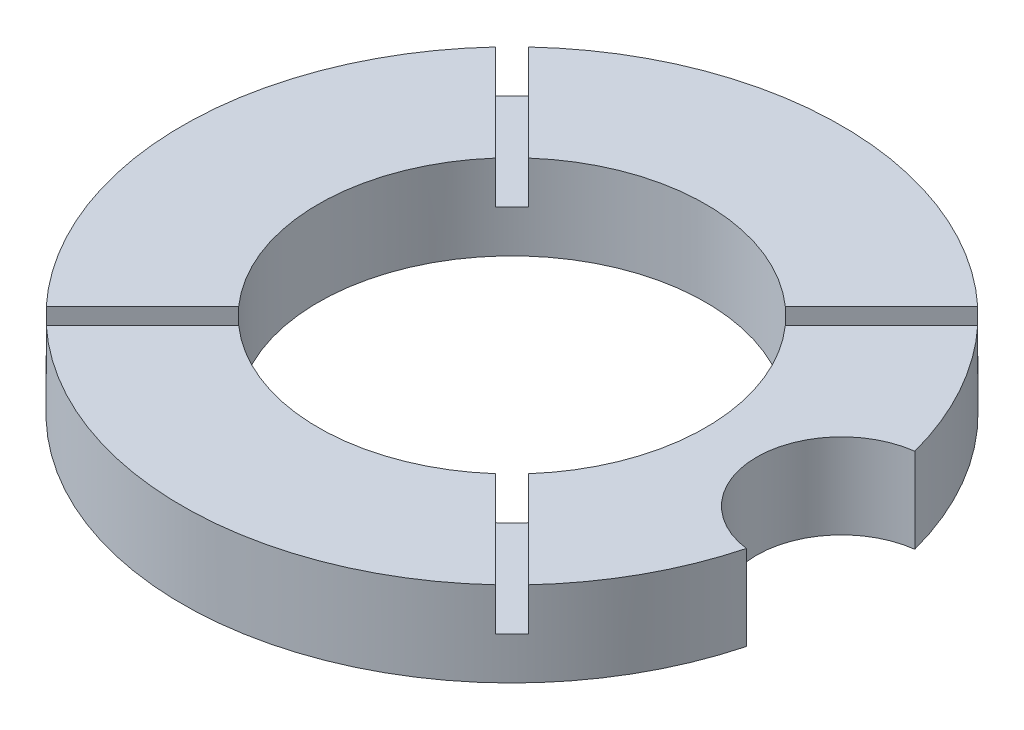
ISO-10303-21;
HEADER;
FILE_DESCRIPTION(('STEP AP214'),'2;1');
FILE_NAME('part.step','',(''),(''),'','','');
FILE_SCHEMA(('AUTOMOTIVE_DESIGN { 1 0 10303 214 1 1 1 1 }'));
ENDSEC;
DATA;
#1=APPLICATION_CONTEXT('core data for automotive mechanical design processes');
#2=APPLICATION_PROTOCOL_DEFINITION('international standard','automotive_design',2000,#1);
#3=PRODUCT_CONTEXT('',#1,'mechanical');
#4=PRODUCT('Part','Part','',(#3));
#5=PRODUCT_RELATED_PRODUCT_CATEGORY('part','',(#4));
#6=PRODUCT_DEFINITION_FORMATION('','',#4);
#7=PRODUCT_DEFINITION_CONTEXT('part definition',#1,'design');
#8=PRODUCT_DEFINITION('design','',#6,#7);
#9=PRODUCT_DEFINITION_SHAPE('','',#8);
#10=(LENGTH_UNIT() NAMED_UNIT(*) SI_UNIT(.MILLI.,.METRE.));
#11=(NAMED_UNIT(*) PLANE_ANGLE_UNIT() SI_UNIT($,.RADIAN.));
#12=(NAMED_UNIT(*) SI_UNIT($,.STERADIAN.) SOLID_ANGLE_UNIT());
#13=UNCERTAINTY_MEASURE_WITH_UNIT(LENGTH_MEASURE(1.E-05),#10,'distance_accuracy_value','');
#14=(GEOMETRIC_REPRESENTATION_CONTEXT(3) GLOBAL_UNCERTAINTY_ASSIGNED_CONTEXT((#13)) GLOBAL_UNIT_ASSIGNED_CONTEXT((#10,
#11,#12)) REPRESENTATION_CONTEXT('',''));
#15=CARTESIAN_POINT('',(0.,0.,0.));
#16=DIRECTION('',(0.,0.,1.));
#17=DIRECTION('',(1.,0.,0.));
#18=AXIS2_PLACEMENT_3D('',#15,#16,#17);
#19=CARTESIAN_POINT('',(0.,12.7,0.));
#20=DIRECTION('',(0.,-1.,0.));
#21=DIRECTION('',(0.,0.,-1.));
#22=AXIS2_PLACEMENT_3D('',#19,#20,#21);
#23=CYLINDRICAL_SURFACE('',#22,49.276);
#24=DIRECTION('',(0.,-1.,0.));
#25=VECTOR('',#24,1.);
#26=CARTESIAN_POINT('',(36.0606234607695,12.7,-33.5820727713553));
#27=LINE('',#26,#25);
#28=CARTESIAN_POINT('',(36.0606234607695,12.7,-33.5820727713553));
#29=VERTEX_POINT('',#28);
#30=CARTESIAN_POINT('',(36.0606234607695,6.35,-33.5820727713553));
#31=VERTEX_POINT('',#30);
#32=EDGE_CURVE('E367',#29,#31,#27,.T.);
#33=ORIENTED_EDGE('',*,*,#32,.F.);
#34=CARTESIAN_POINT('',(0.,12.7,0.));
#35=DIRECTION('',(0.,1.,0.));
#36=DIRECTION('',(0.,0.,1.));
#37=AXIS2_PLACEMENT_3D('',#34,#35,#36);
#38=CIRCLE('',#37,49.276);
#39=CARTESIAN_POINT('',(47.6394020618557,12.7,-12.5941076376559));
#40=VERTEX_POINT('',#39);
#41=EDGE_CURVE('E297',#40,#29,#38,.T.);
#42=ORIENTED_EDGE('',*,*,#41,.F.);
#43=DIRECTION('',(0.,1.,0.));
#44=VECTOR('',#43,1.);
#45=CARTESIAN_POINT('',(47.6394020618557,0.,-12.5941076376559));
#46=LINE('',#45,#44);
#47=CARTESIAN_POINT('',(47.6394020618557,0.,-12.5941076376559));
#48=VERTEX_POINT('',#47);
#49=EDGE_CURVE('E447',#48,#40,#46,.T.);
#50=ORIENTED_EDGE('',*,*,#49,.F.);
#51=CARTESIAN_POINT('',(0.,0.,0.));
#52=DIRECTION('',(0.,1.,0.));
#53=DIRECTION('',(0.,0.,1.));
#54=AXIS2_PLACEMENT_3D('',#51,#52,#53);
#55=CIRCLE('',#54,49.276);
#56=CARTESIAN_POINT('',(47.6394020618557,0.,12.5941076376559));
#57=VERTEX_POINT('',#56);
#58=EDGE_CURVE('E321',#48,#57,#55,.T.);
#59=ORIENTED_EDGE('',*,*,#58,.T.);
#60=DIRECTION('',(0.,1.,0.));
#61=VECTOR('',#60,1.);
#62=CARTESIAN_POINT('',(47.6394020618557,0.,12.5941076376559));
#63=LINE('',#62,#61);
#64=CARTESIAN_POINT('',(47.6394020618557,12.7,12.5941076376559));
#65=VERTEX_POINT('',#64);
#66=EDGE_CURVE('E451',#57,#65,#63,.T.);
#67=ORIENTED_EDGE('',*,*,#66,.T.);
#68=CARTESIAN_POINT('',(36.06062346077,12.7,33.5820727713547));
#69=VERTEX_POINT('',#68);
#70=EDGE_CURVE('E300',#69,#65,#38,.T.);
#71=ORIENTED_EDGE('',*,*,#70,.F.);
#72=DIRECTION('',(0.,-1.,0.));
#73=VECTOR('',#72,1.);
#74=CARTESIAN_POINT('',(36.06062346077,12.7,33.5820727713547));
#75=LINE('',#74,#73);
#76=CARTESIAN_POINT('',(36.06062346077,6.35,33.5820727713547));
#77=VERTEX_POINT('',#76);
#78=EDGE_CURVE('E405',#69,#77,#75,.T.);
#79=ORIENTED_EDGE('',*,*,#78,.T.);
#80=CARTESIAN_POINT('',(0.,6.35,0.));
#81=DIRECTION('',(0.,1.,0.));
#82=DIRECTION('',(0.,0.,1.));
#83=AXIS2_PLACEMENT_3D('',#80,#81,#82);
#84=CIRCLE('',#83,49.276);
#85=CARTESIAN_POINT('',(33.5820727713549,6.35,36.0606234607698));
#86=VERTEX_POINT('',#85);
#87=EDGE_CURVE('E287',#86,#77,#84,.T.);
#88=ORIENTED_EDGE('',*,*,#87,.F.);
#89=DIRECTION('',(0.,-1.,0.));
#90=VECTOR('',#89,1.);
#91=CARTESIAN_POINT('',(33.5820727713549,12.7,36.0606234607698));
#92=LINE('',#91,#90);
#93=CARTESIAN_POINT('',(33.5820727713549,12.7,36.0606234607698));
#94=VERTEX_POINT('',#93);
#95=EDGE_CURVE('E409',#94,#86,#92,.T.);
#96=ORIENTED_EDGE('',*,*,#95,.F.);
#97=CARTESIAN_POINT('',(-33.5820727713546,12.7,36.0606234607701));
#98=VERTEX_POINT('',#97);
#99=EDGE_CURVE('E295',#98,#94,#38,.T.);
#100=ORIENTED_EDGE('',*,*,#99,.F.);
#101=DIRECTION('',(0.,-1.,0.));
#102=VECTOR('',#101,1.);
#103=CARTESIAN_POINT('',(-33.5820727713546,12.7,36.0606234607701));
#104=LINE('',#103,#102);
#105=CARTESIAN_POINT('',(-33.5820727713546,6.35,36.0606234607701));
#106=VERTEX_POINT('',#105);
#107=EDGE_CURVE('E288',#98,#106,#104,.T.);
#108=ORIENTED_EDGE('',*,*,#107,.T.);
#109=CARTESIAN_POINT('',(0.,6.35,0.));
#110=DIRECTION('',(0.,1.,0.));
#111=DIRECTION('',(0.,0.,1.));
#112=AXIS2_PLACEMENT_3D('',#109,#110,#111);
#113=CIRCLE('',#112,49.276);
#114=CARTESIAN_POINT('',(-36.0606234607697,6.35,33.582072771355));
#115=VERTEX_POINT('',#114);
#116=EDGE_CURVE('E285',#115,#106,#113,.T.);
#117=ORIENTED_EDGE('',*,*,#116,.F.);
#118=DIRECTION('',(0.,-1.,0.));
#119=VECTOR('',#118,1.);
#120=CARTESIAN_POINT('',(-36.0606234607697,12.7,33.582072771355));
#121=LINE('',#120,#119);
#122=CARTESIAN_POINT('',(-36.0606234607697,12.7,33.582072771355));
#123=VERTEX_POINT('',#122);
#124=EDGE_CURVE('E267',#123,#115,#121,.T.);
#125=ORIENTED_EDGE('',*,*,#124,.F.);
#126=CARTESIAN_POINT('',(-36.06062346077,12.7,-33.5820727713547));
#127=VERTEX_POINT('',#126);
#128=EDGE_CURVE('E283',#127,#123,#38,.T.);
#129=ORIENTED_EDGE('',*,*,#128,.F.);
#130=DIRECTION('',(0.,-1.,0.));
#131=VECTOR('',#130,1.);
#132=CARTESIAN_POINT('',(-36.06062346077,12.7,-33.5820727713547));
#133=LINE('',#132,#131);
#134=CARTESIAN_POINT('',(-36.06062346077,6.35,-33.5820727713547));
#135=VERTEX_POINT('',#134);
#136=EDGE_CURVE('E439',#127,#135,#133,.T.);
#137=ORIENTED_EDGE('',*,*,#136,.T.);
#138=CARTESIAN_POINT('',(0.,6.35,0.));
#139=DIRECTION('',(0.,1.,0.));
#140=DIRECTION('',(0.,0.,1.));
#141=AXIS2_PLACEMENT_3D('',#138,#139,#140);
#142=CIRCLE('',#141,49.276);
#143=CARTESIAN_POINT('',(-33.5820727713549,6.35,-36.0606234607698));
#144=VERTEX_POINT('',#143);
#145=EDGE_CURVE('E428',#144,#135,#142,.T.);
#146=ORIENTED_EDGE('',*,*,#145,.F.);
#147=DIRECTION('',(0.,-1.,0.));
#148=VECTOR('',#147,1.);
#149=CARTESIAN_POINT('',(-33.5820727713549,12.7,-36.0606234607698));
#150=LINE('',#149,#148);
#151=CARTESIAN_POINT('',(-33.5820727713549,12.7,-36.0606234607698));
#152=VERTEX_POINT('',#151);
#153=EDGE_CURVE('E436',#152,#144,#150,.T.);
#154=ORIENTED_EDGE('',*,*,#153,.F.);
#155=CARTESIAN_POINT('',(33.5820727713544,12.7,-36.0606234607703));
#156=VERTEX_POINT('',#155);
#157=EDGE_CURVE('E294',#156,#152,#38,.T.);
#158=ORIENTED_EDGE('',*,*,#157,.F.);
#159=DIRECTION('',(0.,-1.,0.));
#160=VECTOR('',#159,1.);
#161=CARTESIAN_POINT('',(33.5820727713544,12.7,-36.0606234607703));
#162=LINE('',#161,#160);
#163=CARTESIAN_POINT('',(33.5820727713544,6.35,-36.0606234607703));
#164=VERTEX_POINT('',#163);
#165=EDGE_CURVE('E415',#156,#164,#162,.T.);
#166=ORIENTED_EDGE('',*,*,#165,.T.);
#167=CARTESIAN_POINT('',(0.,6.35,0.));
#168=DIRECTION('',(0.,1.,0.));
#169=DIRECTION('',(0.,0.,1.));
#170=AXIS2_PLACEMENT_3D('',#167,#168,#169);
#171=CIRCLE('',#170,49.276);
#172=EDGE_CURVE('E412',#31,#164,#171,.T.);
#173=ORIENTED_EDGE('',*,*,#172,.F.);
#174=EDGE_LOOP('',(#33,#42,#50,#59,#67,#71,#79,#88,#96,#100,#108,#117,#125,#129,#137,#146,#154,
#158,#166,#173));
#175=FACE_BOUND('',#174,.T.);
#176=ADVANCED_FACE('F139',(#175),#23,.T.);
#177=CARTESIAN_POINT('',(0.,12.7,0.));
#178=DIRECTION('',(0.,1.,0.));
#179=DIRECTION('',(0.,0.,1.));
#180=AXIS2_PLACEMENT_3D('',#177,#178,#179);
#181=PLANE('',#180);
#182=ORIENTED_EDGE('',*,*,#41,.T.);
#183=DIRECTION('',(-0.707106781186539,0.,0.707106781186556));
#184=VECTOR('',#183,1.);
#185=CARTESIAN_POINT('',(1.23927534470754,12.7,1.23927534470751));
#186=LINE('',#185,#184);
#187=CARTESIAN_POINT('',(21.6743118929028,12.7,-19.1957612034882));
#188=VERTEX_POINT('',#187);
#189=EDGE_CURVE('E374',#29,#188,#186,.T.);
#190=ORIENTED_EDGE('',*,*,#189,.T.);
#191=CARTESIAN_POINT('',(0.,12.7,0.));
#192=DIRECTION('',(0.,1.,0.));
#193=DIRECTION('',(0.,0.,1.));
#194=AXIS2_PLACEMENT_3D('',#191,#192,#193);
#195=CIRCLE('',#194,28.952599956);
#196=CARTESIAN_POINT('',(21.6743118929031,12.7,19.1957612034879));
#197=VERTEX_POINT('',#196);
#198=EDGE_CURVE('E467',#197,#188,#195,.T.);
#199=ORIENTED_EDGE('',*,*,#198,.F.);
#200=DIRECTION('',(-0.707106781186549,0.,-0.707106781186546));
#201=VECTOR('',#200,1.);
#202=CARTESIAN_POINT('',(1.23927534470754,12.7,-1.23927534470754));
#203=LINE('',#202,#201);
#204=EDGE_CURVE('E383',#69,#197,#203,.T.);
#205=ORIENTED_EDGE('',*,*,#204,.F.);
#206=ORIENTED_EDGE('',*,*,#70,.T.);
#207=CARTESIAN_POINT('',(49.276,12.7,0.));
#208=DIRECTION('',(0.,1.,0.));
#209=DIRECTION('',(0.,0.,1.));
#210=AXIS2_PLACEMENT_3D('',#207,#208,#209);
#211=CIRCLE('',#210,12.7);
#212=EDGE_CURVE('E442',#40,#65,#211,.T.);
#213=ORIENTED_EDGE('',*,*,#212,.F.);
#214=EDGE_LOOP('',(#182,#190,#199,#205,#206,#213));
#215=FACE_BOUND('',#214,.T.);
#216=ADVANCED_FACE('F490',(#215),#181,.T.);
#217=ORIENTED_EDGE('',*,*,#99,.T.);
#218=DIRECTION('',(-0.707106781186548,0.,-0.707106781186547));
#219=VECTOR('',#218,1.);
#220=CARTESIAN_POINT('',(-1.23927534470752,12.7,1.23927534470753));
#221=LINE('',#220,#219);
#222=CARTESIAN_POINT('',(19.195761203488,12.7,21.674311892903));
#223=VERTEX_POINT('',#222);
#224=EDGE_CURVE('E372',#94,#223,#221,.T.);
#225=ORIENTED_EDGE('',*,*,#224,.T.);
#226=CARTESIAN_POINT('',(-19.1957612034878,12.7,21.6743118929031));
#227=VERTEX_POINT('',#226);
#228=EDGE_CURVE('E460',#227,#223,#195,.T.);
#229=ORIENTED_EDGE('',*,*,#228,.F.);
#230=DIRECTION('',(0.707106781186543,0.,-0.707106781186552));
#231=VECTOR('',#230,1.);
#232=CARTESIAN_POINT('',(1.23927534470755,12.7,1.23927534470753));
#233=LINE('',#232,#231);
#234=EDGE_CURVE('E276',#98,#227,#233,.T.);
#235=ORIENTED_EDGE('',*,*,#234,.F.);
#236=EDGE_LOOP('',(#217,#225,#229,#235));
#237=FACE_BOUND('',#236,.T.);
#238=ADVANCED_FACE('F478',(#237),#181,.T.);
#239=ORIENTED_EDGE('',*,*,#128,.T.);
#240=DIRECTION('',(0.707106781186544,0.,-0.707106781186551));
#241=VECTOR('',#240,1.);
#242=CARTESIAN_POINT('',(-1.23927534470753,12.7,-1.23927534470752));
#243=LINE('',#242,#241);
#244=CARTESIAN_POINT('',(-21.6743118929029,12.7,19.1957612034881));
#245=VERTEX_POINT('',#244);
#246=EDGE_CURVE('E263',#123,#245,#243,.T.);
#247=ORIENTED_EDGE('',*,*,#246,.T.);
#248=CARTESIAN_POINT('',(-21.6743118929031,12.7,-19.1957612034879));
#249=VERTEX_POINT('',#248);
#250=EDGE_CURVE('E458',#249,#245,#195,.T.);
#251=ORIENTED_EDGE('',*,*,#250,.F.);
#252=DIRECTION('',(0.707106781186549,0.,0.707106781186546));
#253=VECTOR('',#252,1.);
#254=CARTESIAN_POINT('',(-1.23927534470754,12.7,1.23927534470754));
#255=LINE('',#254,#253);
#256=EDGE_CURVE('E292',#127,#249,#255,.T.);
#257=ORIENTED_EDGE('',*,*,#256,.F.);
#258=EDGE_LOOP('',(#239,#247,#251,#257));
#259=FACE_BOUND('',#258,.T.);
#260=ADVANCED_FACE('F291',(#259),#181,.T.);
#261=CARTESIAN_POINT('',(0.,12.7,0.));
#262=DIRECTION('',(0.,-1.,0.));
#263=DIRECTION('',(0.,0.,-1.));
#264=AXIS2_PLACEMENT_3D('',#261,#262,#263);
#265=CYLINDRICAL_SURFACE('',#264,28.952599956);
#266=CARTESIAN_POINT('',(0.,0.,0.));
#267=DIRECTION('',(0.,1.,0.));
#268=DIRECTION('',(0.,0.,1.));
#269=AXIS2_PLACEMENT_3D('',#266,#267,#268);
#270=CIRCLE('',#269,28.952599956);
#271=CARTESIAN_POINT('',(0.,0.,28.952599956));
#272=VERTEX_POINT('',#271);
#273=EDGE_CURVE('E455',#272,#272,#270,.T.);
#274=ORIENTED_EDGE('',*,*,#273,.F.);
#275=EDGE_LOOP('',(#274));
#276=FACE_BOUND('',#275,.T.);
#277=ORIENTED_EDGE('',*,*,#198,.T.);
#278=DIRECTION('',(0.,-1.,0.));
#279=VECTOR('',#278,1.);
#280=CARTESIAN_POINT('',(21.6743118929028,12.7,-19.1957612034882));
#281=LINE('',#280,#279);
#282=CARTESIAN_POINT('',(21.6743118929028,6.35,-19.1957612034882));
#283=VERTEX_POINT('',#282);
#284=EDGE_CURVE('E12',#188,#283,#281,.T.);
#285=ORIENTED_EDGE('',*,*,#284,.T.);
#286=CARTESIAN_POINT('',(0.,6.35,0.));
#287=DIRECTION('',(0.,1.,0.));
#288=DIRECTION('',(0.,0.,1.));
#289=AXIS2_PLACEMENT_3D('',#286,#287,#288);
#290=CIRCLE('',#289,28.952599956);
#291=CARTESIAN_POINT('',(19.1957612034877,6.35,-21.6743118929033));
#292=VERTEX_POINT('',#291);
#293=EDGE_CURVE('E347',#283,#292,#290,.T.);
#294=ORIENTED_EDGE('',*,*,#293,.T.);
#295=DIRECTION('',(0.,-1.,0.));
#296=VECTOR('',#295,1.);
#297=CARTESIAN_POINT('',(19.1957612034877,12.7,-21.6743118929033));
#298=LINE('',#297,#296);
#299=CARTESIAN_POINT('',(19.1957612034877,12.7,-21.6743118929033));
#300=VERTEX_POINT('',#299);
#301=EDGE_CURVE('E147',#300,#292,#298,.T.);
#302=ORIENTED_EDGE('',*,*,#301,.F.);
#303=CARTESIAN_POINT('',(-19.195761203488,12.7,-21.674311892903));
#304=VERTEX_POINT('',#303);
#305=EDGE_CURVE('E461',#300,#304,#195,.T.);
#306=ORIENTED_EDGE('',*,*,#305,.T.);
#307=DIRECTION('',(0.,-1.,0.));
#308=VECTOR('',#307,1.);
#309=CARTESIAN_POINT('',(-19.195761203488,12.7,-21.674311892903));
#310=LINE('',#309,#308);
#311=CARTESIAN_POINT('',(-19.195761203488,6.35,-21.674311892903));
#312=VERTEX_POINT('',#311);
#313=EDGE_CURVE('E313',#304,#312,#310,.T.);
#314=ORIENTED_EDGE('',*,*,#313,.T.);
#315=CARTESIAN_POINT('',(0.,6.35,0.));
#316=DIRECTION('',(0.,1.,0.));
#317=DIRECTION('',(0.,0.,1.));
#318=AXIS2_PLACEMENT_3D('',#315,#316,#317);
#319=CIRCLE('',#318,28.952599956);
#320=CARTESIAN_POINT('',(-21.6743118929031,6.35,-19.1957612034879));
#321=VERTEX_POINT('',#320);
#322=EDGE_CURVE('E306',#312,#321,#319,.T.);
#323=ORIENTED_EDGE('',*,*,#322,.T.);
#324=DIRECTION('',(0.,-1.,0.));
#325=VECTOR('',#324,1.);
#326=CARTESIAN_POINT('',(-21.6743118929031,12.7,-19.1957612034879));
#327=LINE('',#326,#325);
#328=EDGE_CURVE('E319',#249,#321,#327,.T.);
#329=ORIENTED_EDGE('',*,*,#328,.F.);
#330=ORIENTED_EDGE('',*,*,#250,.T.);
#331=DIRECTION('',(0.,-1.,0.));
#332=VECTOR('',#331,1.);
#333=CARTESIAN_POINT('',(-21.6743118929029,12.7,19.1957612034881));
#334=LINE('',#333,#332);
#335=CARTESIAN_POINT('',(-21.6743118929029,6.35,19.1957612034881));
#336=VERTEX_POINT('',#335);
#337=EDGE_CURVE('E270',#245,#336,#334,.T.);
#338=ORIENTED_EDGE('',*,*,#337,.T.);
#339=CARTESIAN_POINT('',(0.,6.35,0.));
#340=DIRECTION('',(0.,1.,0.));
#341=DIRECTION('',(0.,0.,1.));
#342=AXIS2_PLACEMENT_3D('',#339,#340,#341);
#343=CIRCLE('',#342,28.952599956);
#344=CARTESIAN_POINT('',(-19.1957612034878,6.35,21.6743118929031));
#345=VERTEX_POINT('',#344);
#346=EDGE_CURVE('E326',#336,#345,#343,.T.);
#347=ORIENTED_EDGE('',*,*,#346,.T.);
#348=DIRECTION('',(0.,-1.,0.));
#349=VECTOR('',#348,1.);
#350=CARTESIAN_POINT('',(-19.1957612034878,12.7,21.6743118929031));
#351=LINE('',#350,#349);
#352=EDGE_CURVE('E330',#227,#345,#351,.T.);
#353=ORIENTED_EDGE('',*,*,#352,.F.);
#354=ORIENTED_EDGE('',*,*,#228,.T.);
#355=DIRECTION('',(0.,-1.,0.));
#356=VECTOR('',#355,1.);
#357=CARTESIAN_POINT('',(19.195761203488,12.7,21.674311892903));
#358=LINE('',#357,#356);
#359=CARTESIAN_POINT('',(19.195761203488,6.35,21.674311892903));
#360=VERTEX_POINT('',#359);
#361=EDGE_CURVE('E343',#223,#360,#358,.T.);
#362=ORIENTED_EDGE('',*,*,#361,.T.);
#363=CARTESIAN_POINT('',(0.,6.35,0.));
#364=DIRECTION('',(0.,1.,0.));
#365=DIRECTION('',(0.,0.,1.));
#366=AXIS2_PLACEMENT_3D('',#363,#364,#365);
#367=CIRCLE('',#366,28.952599956);
#368=CARTESIAN_POINT('',(21.6743118929031,6.35,19.1957612034879));
#369=VERTEX_POINT('',#368);
#370=EDGE_CURVE('E336',#360,#369,#367,.T.);
#371=ORIENTED_EDGE('',*,*,#370,.T.);
#372=DIRECTION('',(0.,-1.,0.));
#373=VECTOR('',#372,1.);
#374=CARTESIAN_POINT('',(21.6743118929031,12.7,19.1957612034879));
#375=LINE('',#374,#373);
#376=EDGE_CURVE('E340',#197,#369,#375,.T.);
#377=ORIENTED_EDGE('',*,*,#376,.F.);
#378=EDGE_LOOP('',(#277,#285,#294,#302,#306,#314,#323,#329,#330,#338,#347,#353,#354,#362,#371,#377));
#379=FACE_BOUND('',#378,.T.);
#380=ADVANCED_FACE('F359',(#276,#379),#265,.F.);
#381=DIRECTION('',(-0.707106781186538,0.,0.707106781186557));
#382=VECTOR('',#381,1.);
#383=CARTESIAN_POINT('',(-1.23927534470756,12.7,-1.23927534470752));
#384=LINE('',#383,#382);
#385=EDGE_CURVE('E356',#156,#300,#384,.T.);
#386=ORIENTED_EDGE('',*,*,#385,.F.);
#387=ORIENTED_EDGE('',*,*,#157,.T.);
#388=DIRECTION('',(0.707106781186548,0.,0.707106781186547));
#389=VECTOR('',#388,1.);
#390=CARTESIAN_POINT('',(1.23927534470752,12.7,-1.23927534470753));
#391=LINE('',#390,#389);
#392=EDGE_CURVE('E420',#152,#304,#391,.T.);
#393=ORIENTED_EDGE('',*,*,#392,.T.);
#394=ORIENTED_EDGE('',*,*,#305,.F.);
#395=EDGE_LOOP('',(#386,#387,#393,#394));
#396=FACE_BOUND('',#395,.T.);
#397=ADVANCED_FACE('F495',(#396),#181,.T.);
#398=CARTESIAN_POINT('',(0.,0.,0.));
#399=DIRECTION('',(0.,1.,0.));
#400=DIRECTION('',(0.,0.,1.));
#401=AXIS2_PLACEMENT_3D('',#398,#399,#400);
#402=PLANE('',#401);
#403=ORIENTED_EDGE('',*,*,#273,.T.);
#404=EDGE_LOOP('',(#403));
#405=FACE_BOUND('',#404,.T.);
#406=ORIENTED_EDGE('',*,*,#58,.F.);
#407=CARTESIAN_POINT('',(49.276,0.,0.));
#408=DIRECTION('',(0.,1.,0.));
#409=DIRECTION('',(0.,0.,1.));
#410=AXIS2_PLACEMENT_3D('',#407,#408,#409);
#411=CIRCLE('',#410,12.7);
#412=EDGE_CURVE('E443',#48,#57,#411,.T.);
#413=ORIENTED_EDGE('',*,*,#412,.T.);
#414=EDGE_LOOP('',(#406,#413));
#415=FACE_BOUND('',#414,.T.);
#416=ADVANCED_FACE('F529',(#405,#415),#402,.F.);
#417=CARTESIAN_POINT('',(49.276,0.,0.));
#418=DIRECTION('',(0.,1.,0.));
#419=DIRECTION('',(0.,0.,1.));
#420=AXIS2_PLACEMENT_3D('',#417,#418,#419);
#421=CYLINDRICAL_SURFACE('',#420,12.7);
#422=ORIENTED_EDGE('',*,*,#212,.T.);
#423=ORIENTED_EDGE('',*,*,#66,.F.);
#424=ORIENTED_EDGE('',*,*,#412,.F.);
#425=ORIENTED_EDGE('',*,*,#49,.T.);
#426=EDGE_LOOP('',(#422,#423,#424,#425));
#427=FACE_BOUND('',#426,.T.);
#428=ADVANCED_FACE('F534',(#427),#421,.F.);
#429=CARTESIAN_POINT('',(-1.23927534470754,6.35,1.23927534470754));
#430=DIRECTION('',(-0.707106781186546,0.,0.707106781186549));
#431=DIRECTION('',(0.707106781186549,0.,0.707106781186546));
#432=AXIS2_PLACEMENT_3D('',#429,#430,#431);
#433=PLANE('',#432);
#434=ORIENTED_EDGE('',*,*,#256,.T.);
#435=ORIENTED_EDGE('',*,*,#328,.T.);
#436=DIRECTION('',(0.707106781186549,0.,0.707106781186546));
#437=VECTOR('',#436,1.);
#438=CARTESIAN_POINT('',(-1.23927534470754,6.35,1.23927534470754));
#439=LINE('',#438,#437);
#440=EDGE_CURVE('E425',#135,#321,#439,.T.);
#441=ORIENTED_EDGE('',*,*,#440,.F.);
#442=ORIENTED_EDGE('',*,*,#136,.F.);
#443=EDGE_LOOP('',(#434,#435,#441,#442));
#444=FACE_BOUND('',#443,.T.);
#445=ADVANCED_FACE('F505',(#444),#433,.F.);
#446=CARTESIAN_POINT('',(1.23927534470752,6.35,-1.23927534470753));
#447=DIRECTION('',(-0.707106781186547,0.,0.707106781186548));
#448=DIRECTION('',(0.707106781186548,0.,0.707106781186547));
#449=AXIS2_PLACEMENT_3D('',#446,#447,#448);
#450=PLANE('',#449);
#451=ORIENTED_EDGE('',*,*,#153,.T.);
#452=DIRECTION('',(0.707106781186548,0.,0.707106781186547));
#453=VECTOR('',#452,1.);
#454=CARTESIAN_POINT('',(1.23927534470752,6.35,-1.23927534470753));
#455=LINE('',#454,#453);
#456=EDGE_CURVE('E421',#144,#312,#455,.T.);
#457=ORIENTED_EDGE('',*,*,#456,.T.);
#458=ORIENTED_EDGE('',*,*,#313,.F.);
#459=ORIENTED_EDGE('',*,*,#392,.F.);
#460=EDGE_LOOP('',(#451,#457,#458,#459));
#461=FACE_BOUND('',#460,.T.);
#462=ADVANCED_FACE('F498',(#461),#450,.T.);
#463=CARTESIAN_POINT('',(0.,6.35,0.));
#464=DIRECTION('',(0.,1.,0.));
#465=DIRECTION('',(0.,0.,1.));
#466=AXIS2_PLACEMENT_3D('',#463,#464,#465);
#467=PLANE('',#466);
#468=ORIENTED_EDGE('',*,*,#145,.T.);
#469=ORIENTED_EDGE('',*,*,#440,.T.);
#470=ORIENTED_EDGE('',*,*,#322,.F.);
#471=ORIENTED_EDGE('',*,*,#456,.F.);
#472=EDGE_LOOP('',(#468,#469,#470,#471));
#473=FACE_BOUND('',#472,.T.);
#474=ADVANCED_FACE('F503',(#473),#467,.T.);
#475=CARTESIAN_POINT('',(-1.23927534470753,6.35,-1.23927534470752));
#476=DIRECTION('',(0.707106781186551,0.,0.707106781186544));
#477=DIRECTION('',(0.707106781186544,0.,-0.707106781186551));
#478=AXIS2_PLACEMENT_3D('',#475,#476,#477);
#479=PLANE('',#478);
#480=ORIENTED_EDGE('',*,*,#124,.T.);
#481=DIRECTION('',(0.707106781186544,0.,-0.707106781186551));
#482=VECTOR('',#481,1.);
#483=CARTESIAN_POINT('',(-1.23927534470753,6.35,-1.23927534470752));
#484=LINE('',#483,#482);
#485=EDGE_CURVE('E391',#115,#336,#484,.T.);
#486=ORIENTED_EDGE('',*,*,#485,.T.);
#487=ORIENTED_EDGE('',*,*,#337,.F.);
#488=ORIENTED_EDGE('',*,*,#246,.F.);
#489=EDGE_LOOP('',(#480,#486,#487,#488));
#490=FACE_BOUND('',#489,.T.);
#491=ADVANCED_FACE('F265',(#490),#479,.T.);
#492=CARTESIAN_POINT('',(1.23927534470755,6.35,1.23927534470753));
#493=DIRECTION('',(0.707106781186552,0.,0.707106781186543));
#494=DIRECTION('',(0.707106781186543,0.,-0.707106781186552));
#495=AXIS2_PLACEMENT_3D('',#492,#493,#494);
#496=PLANE('',#495);
#497=ORIENTED_EDGE('',*,*,#234,.T.);
#498=ORIENTED_EDGE('',*,*,#352,.T.);
#499=DIRECTION('',(0.707106781186543,0.,-0.707106781186552));
#500=VECTOR('',#499,1.);
#501=CARTESIAN_POINT('',(1.23927534470755,6.35,1.23927534470753));
#502=LINE('',#501,#500);
#503=EDGE_CURVE('E394',#106,#345,#502,.T.);
#504=ORIENTED_EDGE('',*,*,#503,.F.);
#505=ORIENTED_EDGE('',*,*,#107,.F.);
#506=EDGE_LOOP('',(#497,#498,#504,#505));
#507=FACE_BOUND('',#506,.T.);
#508=ADVANCED_FACE('F510',(#507),#496,.F.);
#509=CARTESIAN_POINT('',(0.,6.35,0.));
#510=DIRECTION('',(0.,1.,0.));
#511=DIRECTION('',(1.,0.,0.));
#512=AXIS2_PLACEMENT_3D('',#509,#510,#511);
#513=PLANE('',#512);
#514=ORIENTED_EDGE('',*,*,#116,.T.);
#515=ORIENTED_EDGE('',*,*,#503,.T.);
#516=ORIENTED_EDGE('',*,*,#346,.F.);
#517=ORIENTED_EDGE('',*,*,#485,.F.);
#518=EDGE_LOOP('',(#514,#515,#516,#517));
#519=FACE_BOUND('',#518,.T.);
#520=ADVANCED_FACE('F507',(#519),#513,.T.);
#521=CARTESIAN_POINT('',(-1.23927534470752,6.35,1.23927534470753));
#522=DIRECTION('',(0.707106781186547,0.,-0.707106781186548));
#523=DIRECTION('',(-0.707106781186548,0.,-0.707106781186547));
#524=AXIS2_PLACEMENT_3D('',#521,#522,#523);
#525=PLANE('',#524);
#526=ORIENTED_EDGE('',*,*,#95,.T.);
#527=DIRECTION('',(-0.707106781186548,0.,-0.707106781186547));
#528=VECTOR('',#527,1.);
#529=CARTESIAN_POINT('',(-1.23927534470752,6.35,1.23927534470753));
#530=LINE('',#529,#528);
#531=EDGE_CURVE('E379',#86,#360,#530,.T.);
#532=ORIENTED_EDGE('',*,*,#531,.T.);
#533=ORIENTED_EDGE('',*,*,#361,.F.);
#534=ORIENTED_EDGE('',*,*,#224,.F.);
#535=EDGE_LOOP('',(#526,#532,#533,#534));
#536=FACE_BOUND('',#535,.T.);
#537=ADVANCED_FACE('F482',(#536),#525,.T.);
#538=CARTESIAN_POINT('',(1.23927534470754,6.35,-1.23927534470754));
#539=DIRECTION('',(0.707106781186546,0.,-0.707106781186549));
#540=DIRECTION('',(-0.707106781186549,0.,-0.707106781186546));
#541=AXIS2_PLACEMENT_3D('',#538,#539,#540);
#542=PLANE('',#541);
#543=ORIENTED_EDGE('',*,*,#204,.T.);
#544=ORIENTED_EDGE('',*,*,#376,.T.);
#545=DIRECTION('',(-0.707106781186549,0.,-0.707106781186546));
#546=VECTOR('',#545,1.);
#547=CARTESIAN_POINT('',(1.23927534470754,6.35,-1.23927534470754));
#548=LINE('',#547,#546);
#549=EDGE_CURVE('E162',#77,#369,#548,.T.);
#550=ORIENTED_EDGE('',*,*,#549,.F.);
#551=ORIENTED_EDGE('',*,*,#78,.F.);
#552=EDGE_LOOP('',(#543,#544,#550,#551));
#553=FACE_BOUND('',#552,.T.);
#554=ADVANCED_FACE('F488',(#553),#542,.F.);
#555=CARTESIAN_POINT('',(0.,6.35,0.));
#556=DIRECTION('',(0.,1.,0.));
#557=DIRECTION('',(0.,0.,-1.));
#558=AXIS2_PLACEMENT_3D('',#555,#556,#557);
#559=PLANE('',#558);
#560=ORIENTED_EDGE('',*,*,#87,.T.);
#561=ORIENTED_EDGE('',*,*,#549,.T.);
#562=ORIENTED_EDGE('',*,*,#370,.F.);
#563=ORIENTED_EDGE('',*,*,#531,.F.);
#564=EDGE_LOOP('',(#560,#561,#562,#563));
#565=FACE_BOUND('',#564,.T.);
#566=ADVANCED_FACE('F486',(#565),#559,.T.);
#567=CARTESIAN_POINT('',(1.23927534470754,6.35,1.23927534470751));
#568=DIRECTION('',(-0.707106781186556,0.,-0.707106781186539));
#569=DIRECTION('',(-0.707106781186539,0.,0.707106781186556));
#570=AXIS2_PLACEMENT_3D('',#567,#568,#569);
#571=PLANE('',#570);
#572=ORIENTED_EDGE('',*,*,#32,.T.);
#573=DIRECTION('',(-0.707106781186539,0.,0.707106781186556));
#574=VECTOR('',#573,1.);
#575=CARTESIAN_POINT('',(1.23927534470754,6.35,1.23927534470751));
#576=LINE('',#575,#574);
#577=EDGE_CURVE('E363',#31,#283,#576,.T.);
#578=ORIENTED_EDGE('',*,*,#577,.T.);
#579=ORIENTED_EDGE('',*,*,#284,.F.);
#580=ORIENTED_EDGE('',*,*,#189,.F.);
#581=EDGE_LOOP('',(#572,#578,#579,#580));
#582=FACE_BOUND('',#581,.T.);
#583=ADVANCED_FACE('F366',(#582),#571,.T.);
#584=CARTESIAN_POINT('',(-1.23927534470756,6.35,-1.23927534470752));
#585=DIRECTION('',(-0.707106781186557,0.,-0.707106781186538));
#586=DIRECTION('',(-0.707106781186538,0.,0.707106781186557));
#587=AXIS2_PLACEMENT_3D('',#584,#585,#586);
#588=PLANE('',#587);
#589=ORIENTED_EDGE('',*,*,#385,.T.);
#590=ORIENTED_EDGE('',*,*,#301,.T.);
#591=DIRECTION('',(-0.707106781186538,0.,0.707106781186557));
#592=VECTOR('',#591,1.);
#593=CARTESIAN_POINT('',(-1.23927534470756,6.35,-1.23927534470752));
#594=LINE('',#593,#592);
#595=EDGE_CURVE('E154',#164,#292,#594,.T.);
#596=ORIENTED_EDGE('',*,*,#595,.F.);
#597=ORIENTED_EDGE('',*,*,#165,.F.);
#598=EDGE_LOOP('',(#589,#590,#596,#597));
#599=FACE_BOUND('',#598,.T.);
#600=ADVANCED_FACE('F353',(#599),#588,.F.);
#601=CARTESIAN_POINT('',(0.,6.35,0.));
#602=DIRECTION('',(0.,1.,0.));
#603=DIRECTION('',(-1.,0.,0.));
#604=AXIS2_PLACEMENT_3D('',#601,#602,#603);
#605=PLANE('',#604);
#606=ORIENTED_EDGE('',*,*,#172,.T.);
#607=ORIENTED_EDGE('',*,*,#595,.T.);
#608=ORIENTED_EDGE('',*,*,#293,.F.);
#609=ORIENTED_EDGE('',*,*,#577,.F.);
#610=EDGE_LOOP('',(#606,#607,#608,#609));
#611=FACE_BOUND('',#610,.T.);
#612=ADVANCED_FACE('F362',(#611),#605,.T.);
#613=CLOSED_SHELL('',(#176,#216,#238,#260,#380,#397,#416,#428,#445,#462,#474,#491,#508,#520,
#537,#554,#566,#583,#600,#612));
#614=MANIFOLD_SOLID_BREP('B2',#613);
#615=ADVANCED_BREP_SHAPE_REPRESENTATION('',(#18,#614),#14);
#616=SHAPE_DEFINITION_REPRESENTATION(#9,#615);
ENDSEC;
END-ISO-10303-21;
